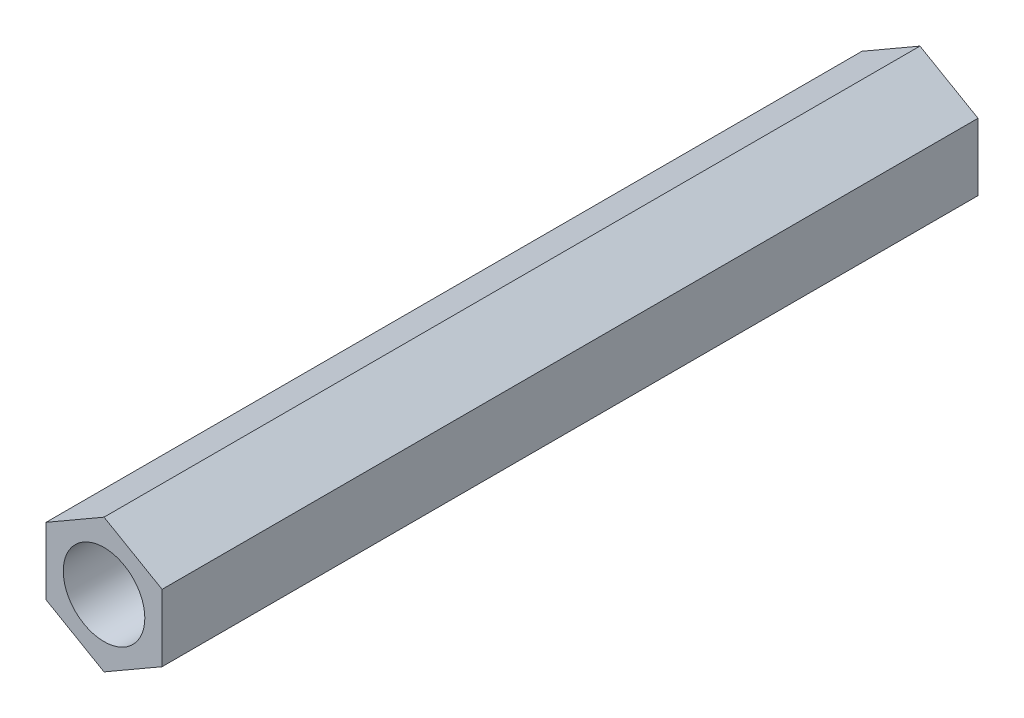
ISO-10303-21;
HEADER;
FILE_DESCRIPTION(('STEP AP214'),'2;1');
FILE_NAME('part.step','',(''),(''),'','','');
FILE_SCHEMA(('AUTOMOTIVE_DESIGN { 1 0 10303 214 1 1 1 1 }'));
ENDSEC;
DATA;
#1=APPLICATION_CONTEXT('core data for automotive mechanical design processes');
#2=APPLICATION_PROTOCOL_DEFINITION('international standard','automotive_design',2000,#1);
#3=PRODUCT_CONTEXT('',#1,'mechanical');
#4=PRODUCT('Part','Part','',(#3));
#5=PRODUCT_RELATED_PRODUCT_CATEGORY('part','',(#4));
#6=PRODUCT_DEFINITION_FORMATION('','',#4);
#7=PRODUCT_DEFINITION_CONTEXT('part definition',#1,'design');
#8=PRODUCT_DEFINITION('design','',#6,#7);
#9=PRODUCT_DEFINITION_SHAPE('','',#8);
#10=(LENGTH_UNIT() NAMED_UNIT(*) SI_UNIT(.MILLI.,.METRE.));
#11=(NAMED_UNIT(*) PLANE_ANGLE_UNIT() SI_UNIT($,.RADIAN.));
#12=(NAMED_UNIT(*) SI_UNIT($,.STERADIAN.) SOLID_ANGLE_UNIT());
#13=UNCERTAINTY_MEASURE_WITH_UNIT(LENGTH_MEASURE(1.E-05),#10,'distance_accuracy_value','');
#14=(GEOMETRIC_REPRESENTATION_CONTEXT(3) GLOBAL_UNCERTAINTY_ASSIGNED_CONTEXT((#13)) GLOBAL_UNIT_ASSIGNED_CONTEXT((#10,
#11,#12)) REPRESENTATION_CONTEXT('',''));
#15=CARTESIAN_POINT('',(0.,0.,0.));
#16=DIRECTION('',(0.,0.,1.));
#17=DIRECTION('',(1.,0.,0.));
#18=AXIS2_PLACEMENT_3D('',#15,#16,#17);
#19=CARTESIAN_POINT('',(0.,0.,30.));
#20=DIRECTION('',(0.,0.,1.));
#21=DIRECTION('',(1.,0.,0.));
#22=AXIS2_PLACEMENT_3D('',#19,#20,#21);
#23=PLANE('',#22);
#24=DIRECTION('',(-0.866025403784442,0.499999999999995,0.));
#25=VECTOR('',#24,1.);
#26=CARTESIAN_POINT('',(2.13382530169226,1.23196461233569,30.));
#27=LINE('',#26,#25);
#28=CARTESIAN_POINT('',(2.13382530169226,1.23196461233569,30.));
#29=VERTEX_POINT('',#28);
#30=CARTESIAN_POINT('',(0.,2.46392922467133,30.));
#31=VERTEX_POINT('',#30);
#32=EDGE_CURVE('E148',#29,#31,#27,.T.);
#33=ORIENTED_EDGE('',*,*,#32,.T.);
#34=DIRECTION('',(-0.866025403784438,-0.500000000000001,0.));
#35=VECTOR('',#34,1.);
#36=CARTESIAN_POINT('',(0.,2.46392922467133,30.));
#37=LINE('',#36,#35);
#38=CARTESIAN_POINT('',(-2.13382530169227,1.23196461233566,30.));
#39=VERTEX_POINT('',#38);
#40=EDGE_CURVE('E96',#31,#39,#37,.T.);
#41=ORIENTED_EDGE('',*,*,#40,.T.);
#42=DIRECTION('',(0.,-1.,0.));
#43=VECTOR('',#42,1.);
#44=CARTESIAN_POINT('',(-2.13382530169227,1.23196461233566,30.));
#45=LINE('',#44,#43);
#46=CARTESIAN_POINT('',(-2.13382530169226,-1.23196461233568,30.));
#47=VERTEX_POINT('',#46);
#48=EDGE_CURVE('E109',#39,#47,#45,.T.);
#49=ORIENTED_EDGE('',*,*,#48,.T.);
#50=DIRECTION('',(0.866025403784442,-0.499999999999995,0.));
#51=VECTOR('',#50,1.);
#52=CARTESIAN_POINT('',(-2.13382530169226,-1.23196461233568,30.));
#53=LINE('',#52,#51);
#54=CARTESIAN_POINT('',(0.,-2.46392922467133,30.));
#55=VERTEX_POINT('',#54);
#56=EDGE_CURVE('E103',#47,#55,#53,.T.);
#57=ORIENTED_EDGE('',*,*,#56,.T.);
#58=DIRECTION('',(0.866025403784434,0.500000000000007,0.));
#59=VECTOR('',#58,1.);
#60=CARTESIAN_POINT('',(0.,-2.46392922467133,30.));
#61=LINE('',#60,#59);
#62=CARTESIAN_POINT('',(2.13382530169228,-1.23196461233565,30.));
#63=VERTEX_POINT('',#62);
#64=EDGE_CURVE('E107',#55,#63,#61,.T.);
#65=ORIENTED_EDGE('',*,*,#64,.T.);
#66=DIRECTION('',(0.,1.,0.));
#67=VECTOR('',#66,1.);
#68=CARTESIAN_POINT('',(2.13382530169228,-1.23196461233565,30.));
#69=LINE('',#68,#67);
#70=EDGE_CURVE('E59',#63,#29,#69,.T.);
#71=ORIENTED_EDGE('',*,*,#70,.T.);
#72=EDGE_LOOP('',(#33,#41,#49,#57,#65,#71));
#73=FACE_BOUND('',#72,.T.);
#74=CARTESIAN_POINT('',(0.,0.,30.));
#75=DIRECTION('',(0.,0.,1.));
#76=DIRECTION('',(1.,0.,0.));
#77=AXIS2_PLACEMENT_3D('',#74,#75,#76);
#78=CIRCLE('',#77,1.5);
#79=CARTESIAN_POINT('',(1.5,0.,30.));
#80=VERTEX_POINT('',#79);
#81=EDGE_CURVE('E136',#80,#80,#78,.T.);
#82=ORIENTED_EDGE('',*,*,#81,.F.);
#83=EDGE_LOOP('',(#82));
#84=FACE_BOUND('',#83,.T.);
#85=ADVANCED_FACE('F41',(#73,#84),#23,.T.);
#86=CARTESIAN_POINT('',(0.,0.,0.));
#87=DIRECTION('',(0.,0.,1.));
#88=DIRECTION('',(1.,0.,0.));
#89=AXIS2_PLACEMENT_3D('',#86,#87,#88);
#90=PLANE('',#89);
#91=DIRECTION('',(-0.866025403784442,0.499999999999995,0.));
#92=VECTOR('',#91,1.);
#93=CARTESIAN_POINT('',(2.13382530169226,1.23196461233569,0.));
#94=LINE('',#93,#92);
#95=CARTESIAN_POINT('',(2.13382530169226,1.23196461233569,0.));
#96=VERTEX_POINT('',#95);
#97=CARTESIAN_POINT('',(0.,2.46392922467133,0.));
#98=VERTEX_POINT('',#97);
#99=EDGE_CURVE('E131',#96,#98,#94,.T.);
#100=ORIENTED_EDGE('',*,*,#99,.F.);
#101=DIRECTION('',(0.,1.,0.));
#102=VECTOR('',#101,1.);
#103=CARTESIAN_POINT('',(2.13382530169228,-1.23196461233565,0.));
#104=LINE('',#103,#102);
#105=CARTESIAN_POINT('',(2.13382530169228,-1.23196461233565,0.));
#106=VERTEX_POINT('',#105);
#107=EDGE_CURVE('E88',#106,#96,#104,.T.);
#108=ORIENTED_EDGE('',*,*,#107,.F.);
#109=DIRECTION('',(0.866025403784434,0.500000000000007,0.));
#110=VECTOR('',#109,1.);
#111=CARTESIAN_POINT('',(0.,-2.46392922467133,0.));
#112=LINE('',#111,#110);
#113=CARTESIAN_POINT('',(0.,-2.46392922467133,0.));
#114=VERTEX_POINT('',#113);
#115=EDGE_CURVE('E82',#114,#106,#112,.T.);
#116=ORIENTED_EDGE('',*,*,#115,.F.);
#117=DIRECTION('',(0.866025403784442,-0.499999999999995,0.));
#118=VECTOR('',#117,1.);
#119=CARTESIAN_POINT('',(-2.13382530169226,-1.23196461233568,0.));
#120=LINE('',#119,#118);
#121=CARTESIAN_POINT('',(-2.13382530169226,-1.23196461233568,0.));
#122=VERTEX_POINT('',#121);
#123=EDGE_CURVE('E118',#122,#114,#120,.T.);
#124=ORIENTED_EDGE('',*,*,#123,.F.);
#125=DIRECTION('',(0.,-1.,0.));
#126=VECTOR('',#125,1.);
#127=CARTESIAN_POINT('',(-2.13382530169227,1.23196461233566,0.));
#128=LINE('',#127,#126);
#129=CARTESIAN_POINT('',(-2.13382530169227,1.23196461233566,0.));
#130=VERTEX_POINT('',#129);
#131=EDGE_CURVE('E139',#130,#122,#128,.T.);
#132=ORIENTED_EDGE('',*,*,#131,.F.);
#133=DIRECTION('',(-0.866025403784438,-0.500000000000001,0.));
#134=VECTOR('',#133,1.);
#135=CARTESIAN_POINT('',(0.,2.46392922467133,0.));
#136=LINE('',#135,#134);
#137=EDGE_CURVE('E135',#98,#130,#136,.T.);
#138=ORIENTED_EDGE('',*,*,#137,.F.);
#139=EDGE_LOOP('',(#100,#108,#116,#124,#132,#138));
#140=FACE_BOUND('',#139,.T.);
#141=CARTESIAN_POINT('',(0.,0.,0.));
#142=DIRECTION('',(0.,0.,1.));
#143=DIRECTION('',(1.,0.,0.));
#144=AXIS2_PLACEMENT_3D('',#141,#142,#143);
#145=CIRCLE('',#144,1.5);
#146=CARTESIAN_POINT('',(1.5,0.,0.));
#147=VERTEX_POINT('',#146);
#148=EDGE_CURVE('E245',#147,#147,#145,.T.);
#149=ORIENTED_EDGE('',*,*,#148,.T.);
#150=EDGE_LOOP('',(#149));
#151=FACE_BOUND('',#150,.T.);
#152=ADVANCED_FACE('F161',(#140,#151),#90,.F.);
#153=CARTESIAN_POINT('',(2.13382530169226,1.23196461233569,30.));
#154=DIRECTION('',(-0.499999999999995,-0.866025403784442,0.));
#155=DIRECTION('',(0.866025403784442,-0.499999999999995,0.));
#156=AXIS2_PLACEMENT_3D('',#153,#154,#155);
#157=PLANE('',#156);
#158=ORIENTED_EDGE('',*,*,#99,.T.);
#159=DIRECTION('',(0.,0.,-1.));
#160=VECTOR('',#159,1.);
#161=CARTESIAN_POINT('',(0.,2.46392922467133,30.));
#162=LINE('',#161,#160);
#163=EDGE_CURVE('E11',#31,#98,#162,.T.);
#164=ORIENTED_EDGE('',*,*,#163,.F.);
#165=ORIENTED_EDGE('',*,*,#32,.F.);
#166=DIRECTION('',(0.,0.,-1.));
#167=VECTOR('',#166,1.);
#168=CARTESIAN_POINT('',(2.13382530169226,1.23196461233569,30.));
#169=LINE('',#168,#167);
#170=EDGE_CURVE('E127',#29,#96,#169,.T.);
#171=ORIENTED_EDGE('',*,*,#170,.T.);
#172=EDGE_LOOP('',(#158,#164,#165,#171));
#173=FACE_BOUND('',#172,.T.);
#174=ADVANCED_FACE('F43',(#173),#157,.F.);
#175=CARTESIAN_POINT('',(0.,2.46392922467133,30.));
#176=DIRECTION('',(0.500000000000001,-0.866025403784438,0.));
#177=DIRECTION('',(0.866025403784438,0.500000000000001,0.));
#178=AXIS2_PLACEMENT_3D('',#175,#176,#177);
#179=PLANE('',#178);
#180=ORIENTED_EDGE('',*,*,#137,.T.);
#181=DIRECTION('',(0.,0.,-1.));
#182=VECTOR('',#181,1.);
#183=CARTESIAN_POINT('',(-2.13382530169227,1.23196461233566,30.));
#184=LINE('',#183,#182);
#185=EDGE_CURVE('E51',#39,#130,#184,.T.);
#186=ORIENTED_EDGE('',*,*,#185,.F.);
#187=ORIENTED_EDGE('',*,*,#40,.F.);
#188=ORIENTED_EDGE('',*,*,#163,.T.);
#189=EDGE_LOOP('',(#180,#186,#187,#188));
#190=FACE_BOUND('',#189,.T.);
#191=ADVANCED_FACE('F186',(#190),#179,.F.);
#192=CARTESIAN_POINT('',(-2.13382530169227,1.23196461233566,30.));
#193=DIRECTION('',(1.,0.,0.));
#194=DIRECTION('',(0.,1.,0.));
#195=AXIS2_PLACEMENT_3D('',#192,#193,#194);
#196=PLANE('',#195);
#197=ORIENTED_EDGE('',*,*,#131,.T.);
#198=DIRECTION('',(0.,0.,-1.));
#199=VECTOR('',#198,1.);
#200=CARTESIAN_POINT('',(-2.13382530169226,-1.23196461233568,30.));
#201=LINE('',#200,#199);
#202=EDGE_CURVE('E120',#47,#122,#201,.T.);
#203=ORIENTED_EDGE('',*,*,#202,.F.);
#204=ORIENTED_EDGE('',*,*,#48,.F.);
#205=ORIENTED_EDGE('',*,*,#185,.T.);
#206=EDGE_LOOP('',(#197,#203,#204,#205));
#207=FACE_BOUND('',#206,.T.);
#208=ADVANCED_FACE('F158',(#207),#196,.F.);
#209=CARTESIAN_POINT('',(-2.13382530169226,-1.23196461233568,30.));
#210=DIRECTION('',(0.499999999999995,0.866025403784442,0.));
#211=DIRECTION('',(-0.866025403784442,0.499999999999995,0.));
#212=AXIS2_PLACEMENT_3D('',#209,#210,#211);
#213=PLANE('',#212);
#214=ORIENTED_EDGE('',*,*,#123,.T.);
#215=DIRECTION('',(0.,0.,-1.));
#216=VECTOR('',#215,1.);
#217=CARTESIAN_POINT('',(0.,-2.46392922467133,30.));
#218=LINE('',#217,#216);
#219=EDGE_CURVE('E115',#55,#114,#218,.T.);
#220=ORIENTED_EDGE('',*,*,#219,.F.);
#221=ORIENTED_EDGE('',*,*,#56,.F.);
#222=ORIENTED_EDGE('',*,*,#202,.T.);
#223=EDGE_LOOP('',(#214,#220,#221,#222));
#224=FACE_BOUND('',#223,.T.);
#225=ADVANCED_FACE('F116',(#224),#213,.F.);
#226=CARTESIAN_POINT('',(0.,-2.46392922467133,30.));
#227=DIRECTION('',(-0.500000000000007,0.866025403784435,0.));
#228=DIRECTION('',(-0.866025403784435,-0.500000000000007,0.));
#229=AXIS2_PLACEMENT_3D('',#226,#227,#228);
#230=PLANE('',#229);
#231=ORIENTED_EDGE('',*,*,#115,.T.);
#232=DIRECTION('',(0.,0.,-1.));
#233=VECTOR('',#232,1.);
#234=CARTESIAN_POINT('',(2.13382530169228,-1.23196461233565,30.));
#235=LINE('',#234,#233);
#236=EDGE_CURVE('E121',#63,#106,#235,.T.);
#237=ORIENTED_EDGE('',*,*,#236,.F.);
#238=ORIENTED_EDGE('',*,*,#64,.F.);
#239=ORIENTED_EDGE('',*,*,#219,.T.);
#240=EDGE_LOOP('',(#231,#237,#238,#239));
#241=FACE_BOUND('',#240,.T.);
#242=ADVANCED_FACE('F123',(#241),#230,.F.);
#243=CARTESIAN_POINT('',(2.13382530169228,-1.23196461233565,30.));
#244=DIRECTION('',(-1.,0.,0.));
#245=DIRECTION('',(0.,-1.,0.));
#246=AXIS2_PLACEMENT_3D('',#243,#244,#245);
#247=PLANE('',#246);
#248=ORIENTED_EDGE('',*,*,#107,.T.);
#249=ORIENTED_EDGE('',*,*,#170,.F.);
#250=ORIENTED_EDGE('',*,*,#70,.F.);
#251=ORIENTED_EDGE('',*,*,#236,.T.);
#252=EDGE_LOOP('',(#248,#249,#250,#251));
#253=FACE_BOUND('',#252,.T.);
#254=ADVANCED_FACE('F166',(#253),#247,.F.);
#255=CARTESIAN_POINT('',(0.,0.,30.));
#256=DIRECTION('',(0.,0.,-1.));
#257=DIRECTION('',(-1.,0.,0.));
#258=AXIS2_PLACEMENT_3D('',#255,#256,#257);
#259=CYLINDRICAL_SURFACE('',#258,1.5);
#260=ORIENTED_EDGE('',*,*,#81,.T.);
#261=EDGE_LOOP('',(#260));
#262=FACE_BOUND('',#261,.T.);
#263=ORIENTED_EDGE('',*,*,#148,.F.);
#264=EDGE_LOOP('',(#263));
#265=FACE_BOUND('',#264,.T.);
#266=ADVANCED_FACE('F168',(#262,#265),#259,.F.);
#267=CLOSED_SHELL('',(#85,#152,#174,#191,#208,#225,#242,#254,#266));
#268=MANIFOLD_SOLID_BREP('B2',#267);
#269=ADVANCED_BREP_SHAPE_REPRESENTATION('',(#18,#268),#14);
#270=SHAPE_DEFINITION_REPRESENTATION(#9,#269);
ENDSEC;
END-ISO-10303-21;
